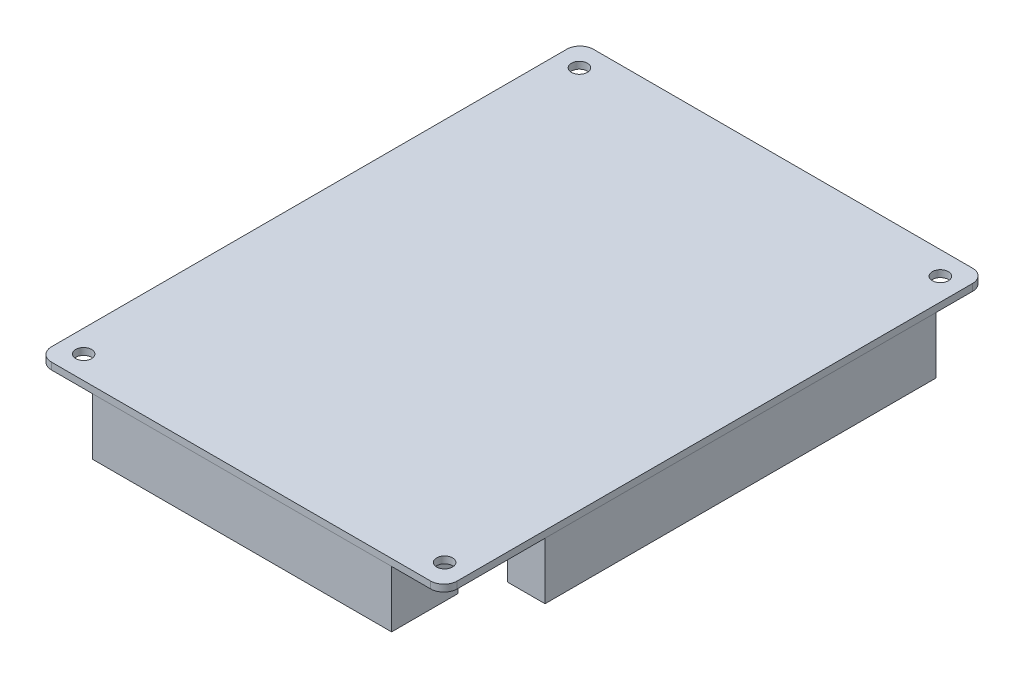
ISO-10303-21;
HEADER;
FILE_DESCRIPTION(('STEP AP214'),'2;1');
FILE_NAME('part.step','',(''),(''),'','','');
FILE_SCHEMA(('AUTOMOTIVE_DESIGN { 1 0 10303 214 1 1 1 1 }'));
ENDSEC;
DATA;
#1=APPLICATION_CONTEXT('core data for automotive mechanical design processes');
#2=APPLICATION_PROTOCOL_DEFINITION('international standard','automotive_design',2000,#1);
#3=PRODUCT_CONTEXT('',#1,'mechanical');
#4=PRODUCT('Part','Part','',(#3));
#5=PRODUCT_RELATED_PRODUCT_CATEGORY('part','',(#4));
#6=PRODUCT_DEFINITION_FORMATION('','',#4);
#7=PRODUCT_DEFINITION_CONTEXT('part definition',#1,'design');
#8=PRODUCT_DEFINITION('design','',#6,#7);
#9=PRODUCT_DEFINITION_SHAPE('','',#8);
#10=(LENGTH_UNIT() NAMED_UNIT(*) SI_UNIT(.MILLI.,.METRE.));
#11=(NAMED_UNIT(*) PLANE_ANGLE_UNIT() SI_UNIT($,.RADIAN.));
#12=(NAMED_UNIT(*) SI_UNIT($,.STERADIAN.) SOLID_ANGLE_UNIT());
#13=UNCERTAINTY_MEASURE_WITH_UNIT(LENGTH_MEASURE(1.E-05),#10,'distance_accuracy_value','');
#14=(GEOMETRIC_REPRESENTATION_CONTEXT(3) GLOBAL_UNCERTAINTY_ASSIGNED_CONTEXT((#13)) GLOBAL_UNIT_ASSIGNED_CONTEXT((#10,
#11,#12)) REPRESENTATION_CONTEXT('',''));
#15=CARTESIAN_POINT('',(0.,0.,0.));
#16=DIRECTION('',(0.,0.,1.));
#17=DIRECTION('',(1.,0.,0.));
#18=AXIS2_PLACEMENT_3D('',#15,#16,#17);
#19=CARTESIAN_POINT('',(0.,0.,0.));
#20=DIRECTION('',(0.,1.,0.));
#21=DIRECTION('',(0.,0.,1.));
#22=AXIS2_PLACEMENT_3D('',#19,#20,#21);
#23=PLANE('',#22);
#24=DIRECTION('',(0.,0.,-1.));
#25=VECTOR('',#24,1.);
#26=CARTESIAN_POINT('',(-45.55,0.,-50.1));
#27=LINE('',#26,#25);
#28=CARTESIAN_POINT('',(-45.55,0.,40.1));
#29=VERTEX_POINT('',#28);
#30=CARTESIAN_POINT('',(-45.55,0.,-50.1));
#31=VERTEX_POINT('',#30);
#32=EDGE_CURVE('E214',#29,#31,#27,.T.);
#33=ORIENTED_EDGE('',*,*,#32,.F.);
#34=DIRECTION('',(-1.,0.,0.));
#35=VECTOR('',#34,1.);
#36=CARTESIAN_POINT('',(-45.55,0.,40.1));
#37=LINE('',#36,#35);
#38=CARTESIAN_POINT('',(-37.05,0.,40.1));
#39=VERTEX_POINT('',#38);
#40=EDGE_CURVE('E227',#39,#29,#37,.T.);
#41=ORIENTED_EDGE('',*,*,#40,.F.);
#42=DIRECTION('',(0.,0.,1.));
#43=VECTOR('',#42,1.);
#44=CARTESIAN_POINT('',(-37.05,0.,-50.1));
#45=LINE('',#44,#43);
#46=CARTESIAN_POINT('',(-37.05,0.,-50.1));
#47=VERTEX_POINT('',#46);
#48=EDGE_CURVE('E236',#47,#39,#45,.T.);
#49=ORIENTED_EDGE('',*,*,#48,.F.);
#50=DIRECTION('',(1.,0.,0.));
#51=VECTOR('',#50,1.);
#52=CARTESIAN_POINT('',(-45.55,0.,-50.1));
#53=LINE('',#52,#51);
#54=EDGE_CURVE('E217',#31,#47,#53,.T.);
#55=ORIENTED_EDGE('',*,*,#54,.F.);
#56=EDGE_LOOP('',(#33,#41,#49,#55));
#57=FACE_BOUND('',#56,.T.);
#58=DIRECTION('',(0.,0.,1.));
#59=VECTOR('',#58,1.);
#60=CARTESIAN_POINT('',(45.55,0.,38.1));
#61=LINE('',#60,#59);
#62=CARTESIAN_POINT('',(45.55,0.,-50.1));
#63=VERTEX_POINT('',#62);
#64=CARTESIAN_POINT('',(45.55,0.,38.1));
#65=VERTEX_POINT('',#64);
#66=EDGE_CURVE('E285',#63,#65,#61,.T.);
#67=ORIENTED_EDGE('',*,*,#66,.F.);
#68=DIRECTION('',(1.,0.,0.));
#69=VECTOR('',#68,1.);
#70=CARTESIAN_POINT('',(45.55,0.,-50.1));
#71=LINE('',#70,#69);
#72=CARTESIAN_POINT('',(37.05,0.,-50.1));
#73=VERTEX_POINT('',#72);
#74=EDGE_CURVE('E290',#73,#63,#71,.T.);
#75=ORIENTED_EDGE('',*,*,#74,.F.);
#76=DIRECTION('',(0.,0.,-1.));
#77=VECTOR('',#76,1.);
#78=CARTESIAN_POINT('',(37.05,0.,38.1));
#79=LINE('',#78,#77);
#80=CARTESIAN_POINT('',(37.05,0.,38.1));
#81=VERTEX_POINT('',#80);
#82=EDGE_CURVE('E302',#81,#73,#79,.T.);
#83=ORIENTED_EDGE('',*,*,#82,.F.);
#84=DIRECTION('',(-1.,0.,0.));
#85=VECTOR('',#84,1.);
#86=CARTESIAN_POINT('',(45.55,0.,38.1));
#87=LINE('',#86,#85);
#88=EDGE_CURVE('E299',#65,#81,#87,.T.);
#89=ORIENTED_EDGE('',*,*,#88,.F.);
#90=EDGE_LOOP('',(#67,#75,#83,#89));
#91=FACE_BOUND('',#90,.T.);
#92=CARTESIAN_POINT('',(-40.7,0.,-55.9));
#93=DIRECTION('',(0.,1.,0.));
#94=DIRECTION('',(0.,0.,1.));
#95=AXIS2_PLACEMENT_3D('',#92,#93,#94);
#96=CIRCLE('',#95,1.8);
#97=CARTESIAN_POINT('',(-40.7,0.,-54.1));
#98=VERTEX_POINT('',#97);
#99=EDGE_CURVE('E321',#98,#98,#96,.T.);
#100=ORIENTED_EDGE('',*,*,#99,.T.);
#101=EDGE_LOOP('',(#100));
#102=FACE_BOUND('',#101,.T.);
#103=CARTESIAN_POINT('',(40.7,0.,55.9));
#104=DIRECTION('',(0.,1.,0.));
#105=DIRECTION('',(0.,0.,1.));
#106=AXIS2_PLACEMENT_3D('',#103,#104,#105);
#107=CIRCLE('',#106,1.8);
#108=CARTESIAN_POINT('',(40.7,0.,57.7));
#109=VERTEX_POINT('',#108);
#110=EDGE_CURVE('E327',#109,#109,#107,.T.);
#111=ORIENTED_EDGE('',*,*,#110,.T.);
#112=EDGE_LOOP('',(#111));
#113=FACE_BOUND('',#112,.T.);
#114=CARTESIAN_POINT('',(40.7,0.,-55.9));
#115=DIRECTION('',(0.,1.,0.));
#116=DIRECTION('',(0.,0.,1.));
#117=AXIS2_PLACEMENT_3D('',#114,#115,#116);
#118=CIRCLE('',#117,1.8);
#119=CARTESIAN_POINT('',(40.7,0.,-54.1));
#120=VERTEX_POINT('',#119);
#121=EDGE_CURVE('E333',#120,#120,#118,.T.);
#122=ORIENTED_EDGE('',*,*,#121,.T.);
#123=EDGE_LOOP('',(#122));
#124=FACE_BOUND('',#123,.T.);
#125=CARTESIAN_POINT('',(-40.7,0.,55.9));
#126=DIRECTION('',(0.,1.,0.));
#127=DIRECTION('',(0.,0.,1.));
#128=AXIS2_PLACEMENT_3D('',#125,#126,#127);
#129=CIRCLE('',#128,1.8);
#130=CARTESIAN_POINT('',(-40.7,0.,57.7));
#131=VERTEX_POINT('',#130);
#132=EDGE_CURVE('E339',#131,#131,#129,.T.);
#133=ORIENTED_EDGE('',*,*,#132,.T.);
#134=EDGE_LOOP('',(#133));
#135=FACE_BOUND('',#134,.T.);
#136=DIRECTION('',(0.,0.,1.));
#137=VECTOR('',#136,1.);
#138=CARTESIAN_POINT('',(-45.75,0.,61.1));
#139=LINE('',#138,#137);
#140=CARTESIAN_POINT('',(-45.75,0.,-58.1));
#141=VERTEX_POINT('',#140);
#142=CARTESIAN_POINT('',(-45.75,0.,58.1));
#143=VERTEX_POINT('',#142);
#144=EDGE_CURVE('E342',#141,#143,#139,.T.);
#145=ORIENTED_EDGE('',*,*,#144,.F.);
#146=CARTESIAN_POINT('',(-42.75,0.,-58.1));
#147=DIRECTION('',(0.,1.,0.));
#148=DIRECTION('',(0.,0.,1.));
#149=AXIS2_PLACEMENT_3D('',#146,#147,#148);
#150=CIRCLE('',#149,3.);
#151=CARTESIAN_POINT('',(-42.75,0.,-61.1));
#152=VERTEX_POINT('',#151);
#153=EDGE_CURVE('E377',#141,#152,#150,.F.);
#154=ORIENTED_EDGE('',*,*,#153,.T.);
#155=DIRECTION('',(-1.,0.,0.));
#156=VECTOR('',#155,1.);
#157=CARTESIAN_POINT('',(45.75,0.,-61.1));
#158=LINE('',#157,#156);
#159=CARTESIAN_POINT('',(42.75,0.,-61.1));
#160=VERTEX_POINT('',#159);
#161=EDGE_CURVE('E347',#160,#152,#158,.T.);
#162=ORIENTED_EDGE('',*,*,#161,.F.);
#163=CARTESIAN_POINT('',(42.75,0.,-58.1));
#164=DIRECTION('',(0.,1.,0.));
#165=DIRECTION('',(0.,0.,1.));
#166=AXIS2_PLACEMENT_3D('',#163,#164,#165);
#167=CIRCLE('',#166,3.);
#168=CARTESIAN_POINT('',(45.75,0.,-58.1));
#169=VERTEX_POINT('',#168);
#170=EDGE_CURVE('E375',#160,#169,#167,.F.);
#171=ORIENTED_EDGE('',*,*,#170,.T.);
#172=DIRECTION('',(0.,0.,-1.));
#173=VECTOR('',#172,1.);
#174=CARTESIAN_POINT('',(45.75,0.,61.1));
#175=LINE('',#174,#173);
#176=CARTESIAN_POINT('',(45.75,0.,58.1));
#177=VERTEX_POINT('',#176);
#178=EDGE_CURVE('E362',#177,#169,#175,.T.);
#179=ORIENTED_EDGE('',*,*,#178,.F.);
#180=CARTESIAN_POINT('',(42.75,0.,58.1));
#181=DIRECTION('',(0.,1.,0.));
#182=DIRECTION('',(0.,0.,1.));
#183=AXIS2_PLACEMENT_3D('',#180,#181,#182);
#184=CIRCLE('',#183,3.);
#185=CARTESIAN_POINT('',(42.75,0.,61.1));
#186=VERTEX_POINT('',#185);
#187=EDGE_CURVE('E373',#177,#186,#184,.F.);
#188=ORIENTED_EDGE('',*,*,#187,.T.);
#189=DIRECTION('',(1.,0.,0.));
#190=VECTOR('',#189,1.);
#191=CARTESIAN_POINT('',(45.75,0.,61.1));
#192=LINE('',#191,#190);
#193=CARTESIAN_POINT('',(-42.75,0.,61.1));
#194=VERTEX_POINT('',#193);
#195=EDGE_CURVE('E359',#194,#186,#192,.T.);
#196=ORIENTED_EDGE('',*,*,#195,.F.);
#197=CARTESIAN_POINT('',(-42.75,0.,58.1));
#198=DIRECTION('',(0.,1.,0.));
#199=DIRECTION('',(0.,0.,1.));
#200=AXIS2_PLACEMENT_3D('',#197,#198,#199);
#201=CIRCLE('',#200,3.);
#202=EDGE_CURVE('E371',#194,#143,#201,.F.);
#203=ORIENTED_EDGE('',*,*,#202,.T.);
#204=EDGE_LOOP('',(#145,#154,#162,#171,#179,#188,#196,#203));
#205=FACE_BOUND('',#204,.T.);
#206=DIRECTION('',(0.,0.,1.));
#207=VECTOR('',#206,1.);
#208=CARTESIAN_POINT('',(18.75,0.,-60.9));
#209=LINE('',#208,#207);
#210=CARTESIAN_POINT('',(18.75,0.,-60.9));
#211=VERTEX_POINT('',#210);
#212=CARTESIAN_POINT('',(18.75,0.,-53.4));
#213=VERTEX_POINT('',#212);
#214=EDGE_CURVE('E252',#211,#213,#209,.T.);
#215=ORIENTED_EDGE('',*,*,#214,.F.);
#216=DIRECTION('',(1.,0.,0.));
#217=VECTOR('',#216,1.);
#218=CARTESIAN_POINT('',(18.75,0.,-60.9));
#219=LINE('',#218,#217);
#220=CARTESIAN_POINT('',(-30.75,0.,-60.9));
#221=VERTEX_POINT('',#220);
#222=EDGE_CURVE('E257',#221,#211,#219,.T.);
#223=ORIENTED_EDGE('',*,*,#222,.F.);
#224=DIRECTION('',(0.,0.,-1.));
#225=VECTOR('',#224,1.);
#226=CARTESIAN_POINT('',(-30.75,0.,-60.9));
#227=LINE('',#226,#225);
#228=CARTESIAN_POINT('',(-30.75,0.,-53.4));
#229=VERTEX_POINT('',#228);
#230=EDGE_CURVE('E269',#229,#221,#227,.T.);
#231=ORIENTED_EDGE('',*,*,#230,.F.);
#232=DIRECTION('',(-1.,0.,0.));
#233=VECTOR('',#232,1.);
#234=CARTESIAN_POINT('',(18.75,0.,-53.4));
#235=LINE('',#234,#233);
#236=EDGE_CURVE('E266',#213,#229,#235,.T.);
#237=ORIENTED_EDGE('',*,*,#236,.F.);
#238=EDGE_LOOP('',(#215,#223,#231,#237));
#239=FACE_BOUND('',#238,.T.);
#240=DIRECTION('',(0.,0.,1.));
#241=VECTOR('',#240,1.);
#242=CARTESIAN_POINT('',(33.75,0.,60.9));
#243=LINE('',#242,#241);
#244=CARTESIAN_POINT('',(33.75,0.,45.9));
#245=VERTEX_POINT('',#244);
#246=CARTESIAN_POINT('',(33.75,0.,60.9));
#247=VERTEX_POINT('',#246);
#248=EDGE_CURVE('E213',#245,#247,#243,.T.);
#249=ORIENTED_EDGE('',*,*,#248,.F.);
#250=DIRECTION('',(1.,0.,0.));
#251=VECTOR('',#250,1.);
#252=CARTESIAN_POINT('',(33.75,0.,45.9));
#253=LINE('',#252,#251);
#254=CARTESIAN_POINT('',(-33.75,0.,45.9));
#255=VERTEX_POINT('',#254);
#256=EDGE_CURVE('E210',#255,#245,#253,.T.);
#257=ORIENTED_EDGE('',*,*,#256,.F.);
#258=DIRECTION('',(0.,0.,-1.));
#259=VECTOR('',#258,1.);
#260=CARTESIAN_POINT('',(-33.75,0.,60.9));
#261=LINE('',#260,#259);
#262=CARTESIAN_POINT('',(-33.75,0.,60.9));
#263=VERTEX_POINT('',#262);
#264=EDGE_CURVE('E53',#263,#255,#261,.T.);
#265=ORIENTED_EDGE('',*,*,#264,.F.);
#266=DIRECTION('',(-1.,0.,0.));
#267=VECTOR('',#266,1.);
#268=CARTESIAN_POINT('',(33.75,0.,60.9));
#269=LINE('',#268,#267);
#270=EDGE_CURVE('E48',#247,#263,#269,.T.);
#271=ORIENTED_EDGE('',*,*,#270,.F.);
#272=EDGE_LOOP('',(#249,#257,#265,#271));
#273=FACE_BOUND('',#272,.T.);
#274=ADVANCED_FACE('F33',(#57,#91,#102,#113,#124,#135,#205,#239,#273),#23,.F.);
#275=CARTESIAN_POINT('',(-45.75,1.5494,61.1));
#276=DIRECTION('',(1.,0.,0.));
#277=DIRECTION('',(0.,0.,-1.));
#278=AXIS2_PLACEMENT_3D('',#275,#276,#277);
#279=PLANE('',#278);
#280=DIRECTION('',(0.,0.,1.));
#281=VECTOR('',#280,1.);
#282=CARTESIAN_POINT('',(-45.75,1.5494,61.1));
#283=LINE('',#282,#281);
#284=CARTESIAN_POINT('',(-45.75,1.5494,-58.1));
#285=VERTEX_POINT('',#284);
#286=CARTESIAN_POINT('',(-45.75,1.5494,58.1));
#287=VERTEX_POINT('',#286);
#288=EDGE_CURVE('E343',#285,#287,#283,.T.);
#289=ORIENTED_EDGE('',*,*,#288,.F.);
#290=DIRECTION('',(0.,-1.,0.));
#291=VECTOR('',#290,1.);
#292=CARTESIAN_POINT('',(-45.75,1.5494,-58.1));
#293=LINE('',#292,#291);
#294=EDGE_CURVE('E368',#285,#141,#293,.T.);
#295=ORIENTED_EDGE('',*,*,#294,.T.);
#296=ORIENTED_EDGE('',*,*,#144,.T.);
#297=DIRECTION('',(0.,-1.,0.));
#298=VECTOR('',#297,1.);
#299=CARTESIAN_POINT('',(-45.75,1.5494,58.1));
#300=LINE('',#299,#298);
#301=EDGE_CURVE('E356',#143,#287,#300,.F.);
#302=ORIENTED_EDGE('',*,*,#301,.T.);
#303=EDGE_LOOP('',(#289,#295,#296,#302));
#304=FACE_BOUND('',#303,.T.);
#305=ADVANCED_FACE('F434',(#304),#279,.F.);
#306=CARTESIAN_POINT('',(45.75,1.5494,61.1));
#307=DIRECTION('',(0.,0.,-1.));
#308=DIRECTION('',(-1.,0.,0.));
#309=AXIS2_PLACEMENT_3D('',#306,#307,#308);
#310=PLANE('',#309);
#311=ORIENTED_EDGE('',*,*,#195,.T.);
#312=DIRECTION('',(0.,-1.,0.));
#313=VECTOR('',#312,1.);
#314=CARTESIAN_POINT('',(42.75,1.5494,61.1));
#315=LINE('',#314,#313);
#316=CARTESIAN_POINT('',(42.75,1.5494,61.1));
#317=VERTEX_POINT('',#316);
#318=EDGE_CURVE('E11',#186,#317,#315,.F.);
#319=ORIENTED_EDGE('',*,*,#318,.T.);
#320=DIRECTION('',(1.,0.,0.));
#321=VECTOR('',#320,1.);
#322=CARTESIAN_POINT('',(45.75,1.5494,61.1));
#323=LINE('',#322,#321);
#324=CARTESIAN_POINT('',(-42.75,1.5494,61.1));
#325=VERTEX_POINT('',#324);
#326=EDGE_CURVE('E346',#325,#317,#323,.T.);
#327=ORIENTED_EDGE('',*,*,#326,.F.);
#328=DIRECTION('',(0.,-1.,0.));
#329=VECTOR('',#328,1.);
#330=CARTESIAN_POINT('',(-42.75,1.5494,61.1));
#331=LINE('',#330,#329);
#332=EDGE_CURVE('E41',#325,#194,#331,.T.);
#333=ORIENTED_EDGE('',*,*,#332,.T.);
#334=EDGE_LOOP('',(#311,#319,#327,#333));
#335=FACE_BOUND('',#334,.T.);
#336=ADVANCED_FACE('F401',(#335),#310,.F.);
#337=CARTESIAN_POINT('',(45.75,1.5494,61.1));
#338=DIRECTION('',(-1.,0.,0.));
#339=DIRECTION('',(0.,0.,1.));
#340=AXIS2_PLACEMENT_3D('',#337,#338,#339);
#341=PLANE('',#340);
#342=ORIENTED_EDGE('',*,*,#178,.T.);
#343=DIRECTION('',(0.,-1.,0.));
#344=VECTOR('',#343,1.);
#345=CARTESIAN_POINT('',(45.75,1.5494,-58.1));
#346=LINE('',#345,#344);
#347=CARTESIAN_POINT('',(45.75,1.5494,-58.1));
#348=VERTEX_POINT('',#347);
#349=EDGE_CURVE('E395',#169,#348,#346,.F.);
#350=ORIENTED_EDGE('',*,*,#349,.T.);
#351=DIRECTION('',(0.,0.,-1.));
#352=VECTOR('',#351,1.);
#353=CARTESIAN_POINT('',(45.75,1.5494,61.1));
#354=LINE('',#353,#352);
#355=CARTESIAN_POINT('',(45.75,1.5494,58.1));
#356=VERTEX_POINT('',#355);
#357=EDGE_CURVE('E350',#356,#348,#354,.T.);
#358=ORIENTED_EDGE('',*,*,#357,.F.);
#359=DIRECTION('',(0.,-1.,0.));
#360=VECTOR('',#359,1.);
#361=CARTESIAN_POINT('',(45.75,1.5494,58.1));
#362=LINE('',#361,#360);
#363=EDGE_CURVE('E392',#356,#177,#362,.T.);
#364=ORIENTED_EDGE('',*,*,#363,.T.);
#365=EDGE_LOOP('',(#342,#350,#358,#364));
#366=FACE_BOUND('',#365,.T.);
#367=ADVANCED_FACE('F415',(#366),#341,.F.);
#368=CARTESIAN_POINT('',(45.75,1.5494,-61.1));
#369=DIRECTION('',(0.,0.,1.));
#370=DIRECTION('',(1.,0.,0.));
#371=AXIS2_PLACEMENT_3D('',#368,#369,#370);
#372=PLANE('',#371);
#373=ORIENTED_EDGE('',*,*,#161,.T.);
#374=DIRECTION('',(0.,-1.,0.));
#375=VECTOR('',#374,1.);
#376=CARTESIAN_POINT('',(-42.75,1.5494,-61.1));
#377=LINE('',#376,#375);
#378=CARTESIAN_POINT('',(-42.75,1.5494,-61.1));
#379=VERTEX_POINT('',#378);
#380=EDGE_CURVE('E382',#152,#379,#377,.F.);
#381=ORIENTED_EDGE('',*,*,#380,.T.);
#382=DIRECTION('',(-1.,0.,0.));
#383=VECTOR('',#382,1.);
#384=CARTESIAN_POINT('',(45.75,1.5494,-61.1));
#385=LINE('',#384,#383);
#386=CARTESIAN_POINT('',(42.75,1.5494,-61.1));
#387=VERTEX_POINT('',#386);
#388=EDGE_CURVE('E353',#387,#379,#385,.T.);
#389=ORIENTED_EDGE('',*,*,#388,.F.);
#390=DIRECTION('',(0.,-1.,0.));
#391=VECTOR('',#390,1.);
#392=CARTESIAN_POINT('',(42.75,1.5494,-61.1));
#393=LINE('',#392,#391);
#394=EDGE_CURVE('E379',#387,#160,#393,.T.);
#395=ORIENTED_EDGE('',*,*,#394,.T.);
#396=EDGE_LOOP('',(#373,#381,#389,#395));
#397=FACE_BOUND('',#396,.T.);
#398=ADVANCED_FACE('F426',(#397),#372,.F.);
#399=CARTESIAN_POINT('',(0.,1.5494,0.));
#400=DIRECTION('',(0.,1.,0.));
#401=DIRECTION('',(0.,0.,1.));
#402=AXIS2_PLACEMENT_3D('',#399,#400,#401);
#403=PLANE('',#402);
#404=CARTESIAN_POINT('',(-40.7,1.5494,-55.9));
#405=DIRECTION('',(0.,1.,0.));
#406=DIRECTION('',(0.,0.,1.));
#407=AXIS2_PLACEMENT_3D('',#404,#405,#406);
#408=CIRCLE('',#407,1.8);
#409=CARTESIAN_POINT('',(-40.7,1.5494,-54.1));
#410=VERTEX_POINT('',#409);
#411=EDGE_CURVE('E318',#410,#410,#408,.T.);
#412=ORIENTED_EDGE('',*,*,#411,.F.);
#413=EDGE_LOOP('',(#412));
#414=FACE_BOUND('',#413,.T.);
#415=CARTESIAN_POINT('',(40.7,1.5494,55.9));
#416=DIRECTION('',(0.,1.,0.));
#417=DIRECTION('',(0.,0.,1.));
#418=AXIS2_PLACEMENT_3D('',#415,#416,#417);
#419=CIRCLE('',#418,1.8);
#420=CARTESIAN_POINT('',(40.7,1.5494,57.7));
#421=VERTEX_POINT('',#420);
#422=EDGE_CURVE('E324',#421,#421,#419,.T.);
#423=ORIENTED_EDGE('',*,*,#422,.F.);
#424=EDGE_LOOP('',(#423));
#425=FACE_BOUND('',#424,.T.);
#426=CARTESIAN_POINT('',(40.7,1.5494,-55.9));
#427=DIRECTION('',(0.,1.,0.));
#428=DIRECTION('',(0.,0.,1.));
#429=AXIS2_PLACEMENT_3D('',#426,#427,#428);
#430=CIRCLE('',#429,1.8);
#431=CARTESIAN_POINT('',(40.7,1.5494,-54.1));
#432=VERTEX_POINT('',#431);
#433=EDGE_CURVE('E330',#432,#432,#430,.T.);
#434=ORIENTED_EDGE('',*,*,#433,.F.);
#435=EDGE_LOOP('',(#434));
#436=FACE_BOUND('',#435,.T.);
#437=CARTESIAN_POINT('',(-40.7,1.5494,55.9));
#438=DIRECTION('',(0.,1.,0.));
#439=DIRECTION('',(0.,0.,1.));
#440=AXIS2_PLACEMENT_3D('',#437,#438,#439);
#441=CIRCLE('',#440,1.8);
#442=CARTESIAN_POINT('',(-40.7,1.5494,57.7));
#443=VERTEX_POINT('',#442);
#444=EDGE_CURVE('E336',#443,#443,#441,.T.);
#445=ORIENTED_EDGE('',*,*,#444,.F.);
#446=EDGE_LOOP('',(#445));
#447=FACE_BOUND('',#446,.T.);
#448=ORIENTED_EDGE('',*,*,#388,.T.);
#449=CARTESIAN_POINT('',(-42.75,1.5494,-58.1));
#450=DIRECTION('',(0.,1.,0.));
#451=DIRECTION('',(0.,0.,1.));
#452=AXIS2_PLACEMENT_3D('',#449,#450,#451);
#453=CIRCLE('',#452,3.);
#454=EDGE_CURVE('E390',#379,#285,#453,.T.);
#455=ORIENTED_EDGE('',*,*,#454,.T.);
#456=ORIENTED_EDGE('',*,*,#288,.T.);
#457=CARTESIAN_POINT('',(-42.75,1.5494,58.1));
#458=DIRECTION('',(0.,1.,0.));
#459=DIRECTION('',(0.,0.,1.));
#460=AXIS2_PLACEMENT_3D('',#457,#458,#459);
#461=CIRCLE('',#460,3.);
#462=EDGE_CURVE('E384',#287,#325,#461,.T.);
#463=ORIENTED_EDGE('',*,*,#462,.T.);
#464=ORIENTED_EDGE('',*,*,#326,.T.);
#465=CARTESIAN_POINT('',(42.75,1.5494,58.1));
#466=DIRECTION('',(0.,1.,0.));
#467=DIRECTION('',(0.,0.,1.));
#468=AXIS2_PLACEMENT_3D('',#465,#466,#467);
#469=CIRCLE('',#468,3.);
#470=EDGE_CURVE('E386',#317,#356,#469,.T.);
#471=ORIENTED_EDGE('',*,*,#470,.T.);
#472=ORIENTED_EDGE('',*,*,#357,.T.);
#473=CARTESIAN_POINT('',(42.75,1.5494,-58.1));
#474=DIRECTION('',(0.,1.,0.));
#475=DIRECTION('',(0.,0.,1.));
#476=AXIS2_PLACEMENT_3D('',#473,#474,#475);
#477=CIRCLE('',#476,3.);
#478=EDGE_CURVE('E388',#348,#387,#477,.T.);
#479=ORIENTED_EDGE('',*,*,#478,.T.);
#480=EDGE_LOOP('',(#448,#455,#456,#463,#464,#471,#472,#479));
#481=FACE_BOUND('',#480,.T.);
#482=ADVANCED_FACE('F419',(#414,#425,#436,#447,#481),#403,.T.);
#483=CARTESIAN_POINT('',(-40.7,1.5494,55.9));
#484=DIRECTION('',(0.,1.,0.));
#485=DIRECTION('',(0.,0.,1.));
#486=AXIS2_PLACEMENT_3D('',#483,#484,#485);
#487=CYLINDRICAL_SURFACE('',#486,1.8);
#488=ORIENTED_EDGE('',*,*,#444,.T.);
#489=EDGE_LOOP('',(#488));
#490=FACE_BOUND('',#489,.T.);
#491=ORIENTED_EDGE('',*,*,#132,.F.);
#492=EDGE_LOOP('',(#491));
#493=FACE_BOUND('',#492,.T.);
#494=ADVANCED_FACE('F685',(#490,#493),#487,.F.);
#495=CARTESIAN_POINT('',(40.7,1.5494,-55.9));
#496=DIRECTION('',(0.,1.,0.));
#497=DIRECTION('',(0.,0.,1.));
#498=AXIS2_PLACEMENT_3D('',#495,#496,#497);
#499=CYLINDRICAL_SURFACE('',#498,1.8);
#500=ORIENTED_EDGE('',*,*,#433,.T.);
#501=EDGE_LOOP('',(#500));
#502=FACE_BOUND('',#501,.T.);
#503=ORIENTED_EDGE('',*,*,#121,.F.);
#504=EDGE_LOOP('',(#503));
#505=FACE_BOUND('',#504,.T.);
#506=ADVANCED_FACE('F682',(#502,#505),#499,.F.);
#507=CARTESIAN_POINT('',(40.7,1.5494,55.9));
#508=DIRECTION('',(0.,1.,0.));
#509=DIRECTION('',(0.,0.,1.));
#510=AXIS2_PLACEMENT_3D('',#507,#508,#509);
#511=CYLINDRICAL_SURFACE('',#510,1.8);
#512=ORIENTED_EDGE('',*,*,#422,.T.);
#513=EDGE_LOOP('',(#512));
#514=FACE_BOUND('',#513,.T.);
#515=ORIENTED_EDGE('',*,*,#110,.F.);
#516=EDGE_LOOP('',(#515));
#517=FACE_BOUND('',#516,.T.);
#518=ADVANCED_FACE('F678',(#514,#517),#511,.F.);
#519=CARTESIAN_POINT('',(-40.7,1.5494,-55.9));
#520=DIRECTION('',(0.,1.,0.));
#521=DIRECTION('',(0.,0.,1.));
#522=AXIS2_PLACEMENT_3D('',#519,#520,#521);
#523=CYLINDRICAL_SURFACE('',#522,1.8);
#524=ORIENTED_EDGE('',*,*,#411,.T.);
#525=EDGE_LOOP('',(#524));
#526=FACE_BOUND('',#525,.T.);
#527=ORIENTED_EDGE('',*,*,#99,.F.);
#528=EDGE_LOOP('',(#527));
#529=FACE_BOUND('',#528,.T.);
#530=ADVANCED_FACE('F464',(#526,#529),#523,.F.);
#531=CARTESIAN_POINT('',(-42.75,1.5494,-58.1));
#532=DIRECTION('',(0.,-1.,0.));
#533=DIRECTION('',(0.,0.,-1.));
#534=AXIS2_PLACEMENT_3D('',#531,#532,#533);
#535=CYLINDRICAL_SURFACE('',#534,3.);
#536=ORIENTED_EDGE('',*,*,#454,.F.);
#537=ORIENTED_EDGE('',*,*,#380,.F.);
#538=ORIENTED_EDGE('',*,*,#153,.F.);
#539=ORIENTED_EDGE('',*,*,#294,.F.);
#540=EDGE_LOOP('',(#536,#537,#538,#539));
#541=FACE_BOUND('',#540,.T.);
#542=ADVANCED_FACE('F431',(#541),#535,.T.);
#543=CARTESIAN_POINT('',(42.75,1.5494,-58.1));
#544=DIRECTION('',(0.,-1.,0.));
#545=DIRECTION('',(0.,0.,-1.));
#546=AXIS2_PLACEMENT_3D('',#543,#544,#545);
#547=CYLINDRICAL_SURFACE('',#546,3.);
#548=ORIENTED_EDGE('',*,*,#478,.F.);
#549=ORIENTED_EDGE('',*,*,#349,.F.);
#550=ORIENTED_EDGE('',*,*,#170,.F.);
#551=ORIENTED_EDGE('',*,*,#394,.F.);
#552=EDGE_LOOP('',(#548,#549,#550,#551));
#553=FACE_BOUND('',#552,.T.);
#554=ADVANCED_FACE('F423',(#553),#547,.T.);
#555=CARTESIAN_POINT('',(42.75,1.5494,58.1));
#556=DIRECTION('',(0.,-1.,0.));
#557=DIRECTION('',(0.,0.,-1.));
#558=AXIS2_PLACEMENT_3D('',#555,#556,#557);
#559=CYLINDRICAL_SURFACE('',#558,3.);
#560=ORIENTED_EDGE('',*,*,#470,.F.);
#561=ORIENTED_EDGE('',*,*,#318,.F.);
#562=ORIENTED_EDGE('',*,*,#187,.F.);
#563=ORIENTED_EDGE('',*,*,#363,.F.);
#564=EDGE_LOOP('',(#560,#561,#562,#563));
#565=FACE_BOUND('',#564,.T.);
#566=ADVANCED_FACE('F412',(#565),#559,.T.);
#567=CARTESIAN_POINT('',(-42.75,1.5494,58.1));
#568=DIRECTION('',(0.,-1.,0.));
#569=DIRECTION('',(0.,0.,-1.));
#570=AXIS2_PLACEMENT_3D('',#567,#568,#569);
#571=CYLINDRICAL_SURFACE('',#570,3.);
#572=ORIENTED_EDGE('',*,*,#462,.F.);
#573=ORIENTED_EDGE('',*,*,#301,.F.);
#574=ORIENTED_EDGE('',*,*,#202,.F.);
#575=ORIENTED_EDGE('',*,*,#332,.F.);
#576=EDGE_LOOP('',(#572,#573,#574,#575));
#577=FACE_BOUND('',#576,.T.);
#578=ADVANCED_FACE('F35',(#577),#571,.T.);
#579=CARTESIAN_POINT('',(45.55,-13.,38.1));
#580=DIRECTION('',(-1.,0.,0.));
#581=DIRECTION('',(0.,0.,1.));
#582=AXIS2_PLACEMENT_3D('',#579,#580,#581);
#583=PLANE('',#582);
#584=ORIENTED_EDGE('',*,*,#66,.T.);
#585=DIRECTION('',(0.,1.,0.));
#586=VECTOR('',#585,1.);
#587=CARTESIAN_POINT('',(45.55,-13.,38.1));
#588=LINE('',#587,#586);
#589=CARTESIAN_POINT('',(45.55,-13.,38.1));
#590=VERTEX_POINT('',#589);
#591=EDGE_CURVE('E315',#590,#65,#588,.T.);
#592=ORIENTED_EDGE('',*,*,#591,.F.);
#593=DIRECTION('',(0.,0.,1.));
#594=VECTOR('',#593,1.);
#595=CARTESIAN_POINT('',(45.55,-13.,38.1));
#596=LINE('',#595,#594);
#597=CARTESIAN_POINT('',(45.55,-13.,-50.1));
#598=VERTEX_POINT('',#597);
#599=EDGE_CURVE('E286',#598,#590,#596,.T.);
#600=ORIENTED_EDGE('',*,*,#599,.F.);
#601=DIRECTION('',(0.,1.,0.));
#602=VECTOR('',#601,1.);
#603=CARTESIAN_POINT('',(45.55,-13.,-50.1));
#604=LINE('',#603,#602);
#605=EDGE_CURVE('E296',#598,#63,#604,.T.);
#606=ORIENTED_EDGE('',*,*,#605,.T.);
#607=EDGE_LOOP('',(#584,#592,#600,#606));
#608=FACE_BOUND('',#607,.T.);
#609=ADVANCED_FACE('F437',(#608),#583,.F.);
#610=CARTESIAN_POINT('',(45.55,-13.,38.1));
#611=DIRECTION('',(0.,0.,-1.));
#612=DIRECTION('',(-1.,0.,0.));
#613=AXIS2_PLACEMENT_3D('',#610,#611,#612);
#614=PLANE('',#613);
#615=ORIENTED_EDGE('',*,*,#88,.T.);
#616=DIRECTION('',(0.,1.,0.));
#617=VECTOR('',#616,1.);
#618=CARTESIAN_POINT('',(37.05,-13.,38.1));
#619=LINE('',#618,#617);
#620=CARTESIAN_POINT('',(37.05,-13.,38.1));
#621=VERTEX_POINT('',#620);
#622=EDGE_CURVE('E312',#621,#81,#619,.T.);
#623=ORIENTED_EDGE('',*,*,#622,.F.);
#624=DIRECTION('',(-1.,0.,0.));
#625=VECTOR('',#624,1.);
#626=CARTESIAN_POINT('',(45.55,-13.,38.1));
#627=LINE('',#626,#625);
#628=EDGE_CURVE('E289',#590,#621,#627,.T.);
#629=ORIENTED_EDGE('',*,*,#628,.F.);
#630=ORIENTED_EDGE('',*,*,#591,.T.);
#631=EDGE_LOOP('',(#615,#623,#629,#630));
#632=FACE_BOUND('',#631,.T.);
#633=ADVANCED_FACE('F442',(#632),#614,.F.);
#634=CARTESIAN_POINT('',(37.05,-13.,38.1));
#635=DIRECTION('',(1.,0.,0.));
#636=DIRECTION('',(0.,0.,-1.));
#637=AXIS2_PLACEMENT_3D('',#634,#635,#636);
#638=PLANE('',#637);
#639=ORIENTED_EDGE('',*,*,#82,.T.);
#640=DIRECTION('',(0.,1.,0.));
#641=VECTOR('',#640,1.);
#642=CARTESIAN_POINT('',(37.05,-13.,-50.1));
#643=LINE('',#642,#641);
#644=CARTESIAN_POINT('',(37.05,-13.,-50.1));
#645=VERTEX_POINT('',#644);
#646=EDGE_CURVE('E309',#645,#73,#643,.T.);
#647=ORIENTED_EDGE('',*,*,#646,.F.);
#648=DIRECTION('',(0.,0.,-1.));
#649=VECTOR('',#648,1.);
#650=CARTESIAN_POINT('',(37.05,-13.,38.1));
#651=LINE('',#650,#649);
#652=EDGE_CURVE('E292',#621,#645,#651,.T.);
#653=ORIENTED_EDGE('',*,*,#652,.F.);
#654=ORIENTED_EDGE('',*,*,#622,.T.);
#655=EDGE_LOOP('',(#639,#647,#653,#654));
#656=FACE_BOUND('',#655,.T.);
#657=ADVANCED_FACE('F498',(#656),#638,.F.);
#658=CARTESIAN_POINT('',(45.55,-13.,-50.1));
#659=DIRECTION('',(0.,0.,1.));
#660=DIRECTION('',(1.,0.,0.));
#661=AXIS2_PLACEMENT_3D('',#658,#659,#660);
#662=PLANE('',#661);
#663=ORIENTED_EDGE('',*,*,#74,.T.);
#664=ORIENTED_EDGE('',*,*,#605,.F.);
#665=DIRECTION('',(1.,0.,0.));
#666=VECTOR('',#665,1.);
#667=CARTESIAN_POINT('',(45.55,-13.,-50.1));
#668=LINE('',#667,#666);
#669=EDGE_CURVE('E294',#645,#598,#668,.T.);
#670=ORIENTED_EDGE('',*,*,#669,.F.);
#671=ORIENTED_EDGE('',*,*,#646,.T.);
#672=EDGE_LOOP('',(#663,#664,#670,#671));
#673=FACE_BOUND('',#672,.T.);
#674=ADVANCED_FACE('F508',(#673),#662,.F.);
#675=CARTESIAN_POINT('',(0.,-13.,0.));
#676=DIRECTION('',(0.,1.,0.));
#677=DIRECTION('',(0.,0.,1.));
#678=AXIS2_PLACEMENT_3D('',#675,#676,#677);
#679=PLANE('',#678);
#680=ORIENTED_EDGE('',*,*,#599,.T.);
#681=ORIENTED_EDGE('',*,*,#628,.T.);
#682=ORIENTED_EDGE('',*,*,#652,.T.);
#683=ORIENTED_EDGE('',*,*,#669,.T.);
#684=EDGE_LOOP('',(#680,#681,#682,#683));
#685=FACE_BOUND('',#684,.T.);
#686=ADVANCED_FACE('F518',(#685),#679,.F.);
#687=CARTESIAN_POINT('',(18.75,-13.,-60.9));
#688=DIRECTION('',(-1.,0.,0.));
#689=DIRECTION('',(0.,0.,1.));
#690=AXIS2_PLACEMENT_3D('',#687,#688,#689);
#691=PLANE('',#690);
#692=ORIENTED_EDGE('',*,*,#214,.T.);
#693=DIRECTION('',(0.,1.,0.));
#694=VECTOR('',#693,1.);
#695=CARTESIAN_POINT('',(18.75,-13.,-53.4));
#696=LINE('',#695,#694);
#697=CARTESIAN_POINT('',(18.75,-13.,-53.4));
#698=VERTEX_POINT('',#697);
#699=EDGE_CURVE('E282',#698,#213,#696,.T.);
#700=ORIENTED_EDGE('',*,*,#699,.F.);
#701=DIRECTION('',(0.,0.,1.));
#702=VECTOR('',#701,1.);
#703=CARTESIAN_POINT('',(18.75,-13.,-60.9));
#704=LINE('',#703,#702);
#705=CARTESIAN_POINT('',(18.75,-13.,-60.9));
#706=VERTEX_POINT('',#705);
#707=EDGE_CURVE('E253',#706,#698,#704,.T.);
#708=ORIENTED_EDGE('',*,*,#707,.F.);
#709=DIRECTION('',(0.,1.,0.));
#710=VECTOR('',#709,1.);
#711=CARTESIAN_POINT('',(18.75,-13.,-60.9));
#712=LINE('',#711,#710);
#713=EDGE_CURVE('E263',#706,#211,#712,.T.);
#714=ORIENTED_EDGE('',*,*,#713,.T.);
#715=EDGE_LOOP('',(#692,#700,#708,#714));
#716=FACE_BOUND('',#715,.T.);
#717=ADVANCED_FACE('F528',(#716),#691,.F.);
#718=CARTESIAN_POINT('',(18.75,-13.,-53.4));
#719=DIRECTION('',(0.,0.,-1.));
#720=DIRECTION('',(-1.,0.,0.));
#721=AXIS2_PLACEMENT_3D('',#718,#719,#720);
#722=PLANE('',#721);
#723=ORIENTED_EDGE('',*,*,#236,.T.);
#724=DIRECTION('',(0.,1.,0.));
#725=VECTOR('',#724,1.);
#726=CARTESIAN_POINT('',(-30.75,-13.,-53.4));
#727=LINE('',#726,#725);
#728=CARTESIAN_POINT('',(-30.75,-13.,-53.4));
#729=VERTEX_POINT('',#728);
#730=EDGE_CURVE('E279',#729,#229,#727,.T.);
#731=ORIENTED_EDGE('',*,*,#730,.F.);
#732=DIRECTION('',(-1.,0.,0.));
#733=VECTOR('',#732,1.);
#734=CARTESIAN_POINT('',(18.75,-13.,-53.4));
#735=LINE('',#734,#733);
#736=EDGE_CURVE('E256',#698,#729,#735,.T.);
#737=ORIENTED_EDGE('',*,*,#736,.F.);
#738=ORIENTED_EDGE('',*,*,#699,.T.);
#739=EDGE_LOOP('',(#723,#731,#737,#738));
#740=FACE_BOUND('',#739,.T.);
#741=ADVANCED_FACE('F538',(#740),#722,.F.);
#742=CARTESIAN_POINT('',(-30.75,-13.,-60.9));
#743=DIRECTION('',(1.,0.,0.));
#744=DIRECTION('',(0.,0.,-1.));
#745=AXIS2_PLACEMENT_3D('',#742,#743,#744);
#746=PLANE('',#745);
#747=ORIENTED_EDGE('',*,*,#230,.T.);
#748=DIRECTION('',(0.,1.,0.));
#749=VECTOR('',#748,1.);
#750=CARTESIAN_POINT('',(-30.75,-13.,-60.9));
#751=LINE('',#750,#749);
#752=CARTESIAN_POINT('',(-30.75,-13.,-60.9));
#753=VERTEX_POINT('',#752);
#754=EDGE_CURVE('E276',#753,#221,#751,.T.);
#755=ORIENTED_EDGE('',*,*,#754,.F.);
#756=DIRECTION('',(0.,0.,-1.));
#757=VECTOR('',#756,1.);
#758=CARTESIAN_POINT('',(-30.75,-13.,-60.9));
#759=LINE('',#758,#757);
#760=EDGE_CURVE('E259',#729,#753,#759,.T.);
#761=ORIENTED_EDGE('',*,*,#760,.F.);
#762=ORIENTED_EDGE('',*,*,#730,.T.);
#763=EDGE_LOOP('',(#747,#755,#761,#762));
#764=FACE_BOUND('',#763,.T.);
#765=ADVANCED_FACE('F548',(#764),#746,.F.);
#766=CARTESIAN_POINT('',(18.75,-13.,-60.9));
#767=DIRECTION('',(0.,0.,1.));
#768=DIRECTION('',(1.,0.,0.));
#769=AXIS2_PLACEMENT_3D('',#766,#767,#768);
#770=PLANE('',#769);
#771=ORIENTED_EDGE('',*,*,#222,.T.);
#772=ORIENTED_EDGE('',*,*,#713,.F.);
#773=DIRECTION('',(1.,0.,0.));
#774=VECTOR('',#773,1.);
#775=CARTESIAN_POINT('',(18.75,-13.,-60.9));
#776=LINE('',#775,#774);
#777=EDGE_CURVE('E261',#753,#706,#776,.T.);
#778=ORIENTED_EDGE('',*,*,#777,.F.);
#779=ORIENTED_EDGE('',*,*,#754,.T.);
#780=EDGE_LOOP('',(#771,#772,#778,#779));
#781=FACE_BOUND('',#780,.T.);
#782=ADVANCED_FACE('F558',(#781),#770,.F.);
#783=CARTESIAN_POINT('',(0.,-13.,0.));
#784=DIRECTION('',(0.,-1.,0.));
#785=DIRECTION('',(0.,0.,-1.));
#786=AXIS2_PLACEMENT_3D('',#783,#784,#785);
#787=PLANE('',#786);
#788=ORIENTED_EDGE('',*,*,#707,.T.);
#789=ORIENTED_EDGE('',*,*,#736,.T.);
#790=ORIENTED_EDGE('',*,*,#760,.T.);
#791=ORIENTED_EDGE('',*,*,#777,.T.);
#792=EDGE_LOOP('',(#788,#789,#790,#791));
#793=FACE_BOUND('',#792,.T.);
#794=ADVANCED_FACE('F568',(#793),#787,.T.);
#795=CARTESIAN_POINT('',(-45.55,-13.,-50.1));
#796=DIRECTION('',(1.,0.,0.));
#797=DIRECTION('',(0.,0.,-1.));
#798=AXIS2_PLACEMENT_3D('',#795,#796,#797);
#799=PLANE('',#798);
#800=ORIENTED_EDGE('',*,*,#32,.T.);
#801=DIRECTION('',(0.,1.,0.));
#802=VECTOR('',#801,1.);
#803=CARTESIAN_POINT('',(-45.55,-13.,-50.1));
#804=LINE('',#803,#802);
#805=CARTESIAN_POINT('',(-45.55,-13.,-50.1));
#806=VERTEX_POINT('',#805);
#807=EDGE_CURVE('E249',#806,#31,#804,.T.);
#808=ORIENTED_EDGE('',*,*,#807,.F.);
#809=DIRECTION('',(0.,0.,-1.));
#810=VECTOR('',#809,1.);
#811=CARTESIAN_POINT('',(-45.55,-13.,-50.1));
#812=LINE('',#811,#810);
#813=CARTESIAN_POINT('',(-45.55,-13.,40.1));
#814=VERTEX_POINT('',#813);
#815=EDGE_CURVE('E223',#814,#806,#812,.T.);
#816=ORIENTED_EDGE('',*,*,#815,.F.);
#817=DIRECTION('',(0.,1.,0.));
#818=VECTOR('',#817,1.);
#819=CARTESIAN_POINT('',(-45.55,-13.,40.1));
#820=LINE('',#819,#818);
#821=EDGE_CURVE('E232',#814,#29,#820,.T.);
#822=ORIENTED_EDGE('',*,*,#821,.T.);
#823=EDGE_LOOP('',(#800,#808,#816,#822));
#824=FACE_BOUND('',#823,.T.);
#825=ADVANCED_FACE('F578',(#824),#799,.F.);
#826=CARTESIAN_POINT('',(-45.55,-13.,-50.1));
#827=DIRECTION('',(0.,0.,1.));
#828=DIRECTION('',(1.,0.,0.));
#829=AXIS2_PLACEMENT_3D('',#826,#827,#828);
#830=PLANE('',#829);
#831=ORIENTED_EDGE('',*,*,#54,.T.);
#832=DIRECTION('',(0.,1.,0.));
#833=VECTOR('',#832,1.);
#834=CARTESIAN_POINT('',(-37.05,-13.,-50.1));
#835=LINE('',#834,#833);
#836=CARTESIAN_POINT('',(-37.05,-13.,-50.1));
#837=VERTEX_POINT('',#836);
#838=EDGE_CURVE('E246',#837,#47,#835,.T.);
#839=ORIENTED_EDGE('',*,*,#838,.F.);
#840=DIRECTION('',(1.,0.,0.));
#841=VECTOR('',#840,1.);
#842=CARTESIAN_POINT('',(-45.55,-13.,-50.1));
#843=LINE('',#842,#841);
#844=EDGE_CURVE('E226',#806,#837,#843,.T.);
#845=ORIENTED_EDGE('',*,*,#844,.F.);
#846=ORIENTED_EDGE('',*,*,#807,.T.);
#847=EDGE_LOOP('',(#831,#839,#845,#846));
#848=FACE_BOUND('',#847,.T.);
#849=ADVANCED_FACE('F588',(#848),#830,.F.);
#850=CARTESIAN_POINT('',(-37.05,-13.,-50.1));
#851=DIRECTION('',(-1.,0.,0.));
#852=DIRECTION('',(0.,0.,1.));
#853=AXIS2_PLACEMENT_3D('',#850,#851,#852);
#854=PLANE('',#853);
#855=ORIENTED_EDGE('',*,*,#48,.T.);
#856=DIRECTION('',(0.,1.,0.));
#857=VECTOR('',#856,1.);
#858=CARTESIAN_POINT('',(-37.05,-13.,40.1));
#859=LINE('',#858,#857);
#860=CARTESIAN_POINT('',(-37.05,-13.,40.1));
#861=VERTEX_POINT('',#860);
#862=EDGE_CURVE('E243',#861,#39,#859,.T.);
#863=ORIENTED_EDGE('',*,*,#862,.F.);
#864=DIRECTION('',(0.,0.,1.));
#865=VECTOR('',#864,1.);
#866=CARTESIAN_POINT('',(-37.05,-13.,-50.1));
#867=LINE('',#866,#865);
#868=EDGE_CURVE('E229',#837,#861,#867,.T.);
#869=ORIENTED_EDGE('',*,*,#868,.F.);
#870=ORIENTED_EDGE('',*,*,#838,.T.);
#871=EDGE_LOOP('',(#855,#863,#869,#870));
#872=FACE_BOUND('',#871,.T.);
#873=ADVANCED_FACE('F598',(#872),#854,.F.);
#874=CARTESIAN_POINT('',(-45.55,-13.,40.1));
#875=DIRECTION('',(0.,0.,-1.));
#876=DIRECTION('',(-1.,0.,0.));
#877=AXIS2_PLACEMENT_3D('',#874,#875,#876);
#878=PLANE('',#877);
#879=ORIENTED_EDGE('',*,*,#40,.T.);
#880=ORIENTED_EDGE('',*,*,#821,.F.);
#881=DIRECTION('',(-1.,0.,0.));
#882=VECTOR('',#881,1.);
#883=CARTESIAN_POINT('',(-45.55,-13.,40.1));
#884=LINE('',#883,#882);
#885=EDGE_CURVE('E231',#861,#814,#884,.T.);
#886=ORIENTED_EDGE('',*,*,#885,.F.);
#887=ORIENTED_EDGE('',*,*,#862,.T.);
#888=EDGE_LOOP('',(#879,#880,#886,#887));
#889=FACE_BOUND('',#888,.T.);
#890=ADVANCED_FACE('F608',(#889),#878,.F.);
#891=CARTESIAN_POINT('',(0.,-13.,0.));
#892=DIRECTION('',(0.,1.,0.));
#893=DIRECTION('',(0.,0.,1.));
#894=AXIS2_PLACEMENT_3D('',#891,#892,#893);
#895=PLANE('',#894);
#896=ORIENTED_EDGE('',*,*,#815,.T.);
#897=ORIENTED_EDGE('',*,*,#844,.T.);
#898=ORIENTED_EDGE('',*,*,#868,.T.);
#899=ORIENTED_EDGE('',*,*,#885,.T.);
#900=EDGE_LOOP('',(#896,#897,#898,#899));
#901=FACE_BOUND('',#900,.T.);
#902=ADVANCED_FACE('F618',(#901),#895,.F.);
#903=CARTESIAN_POINT('',(33.75,-13.,60.9));
#904=DIRECTION('',(-1.,0.,0.));
#905=DIRECTION('',(0.,0.,1.));
#906=AXIS2_PLACEMENT_3D('',#903,#904,#905);
#907=PLANE('',#906);
#908=ORIENTED_EDGE('',*,*,#248,.T.);
#909=DIRECTION('',(0.,1.,0.));
#910=VECTOR('',#909,1.);
#911=CARTESIAN_POINT('',(33.75,-13.,60.9));
#912=LINE('',#911,#910);
#913=CARTESIAN_POINT('',(33.75,-13.,60.9));
#914=VERTEX_POINT('',#913);
#915=EDGE_CURVE('E194',#914,#247,#912,.T.);
#916=ORIENTED_EDGE('',*,*,#915,.F.);
#917=DIRECTION('',(0.,0.,1.));
#918=VECTOR('',#917,1.);
#919=CARTESIAN_POINT('',(33.75,-13.,60.9));
#920=LINE('',#919,#918);
#921=CARTESIAN_POINT('',(33.75,-13.,45.9));
#922=VERTEX_POINT('',#921);
#923=EDGE_CURVE('E201',#922,#914,#920,.T.);
#924=ORIENTED_EDGE('',*,*,#923,.F.);
#925=DIRECTION('',(0.,1.,0.));
#926=VECTOR('',#925,1.);
#927=CARTESIAN_POINT('',(33.75,-13.,45.9));
#928=LINE('',#927,#926);
#929=EDGE_CURVE('E772',#922,#245,#928,.T.);
#930=ORIENTED_EDGE('',*,*,#929,.T.);
#931=EDGE_LOOP('',(#908,#916,#924,#930));
#932=FACE_BOUND('',#931,.T.);
#933=ADVANCED_FACE('F212',(#932),#907,.F.);
#934=CARTESIAN_POINT('',(33.75,-13.,60.9));
#935=DIRECTION('',(0.,0.,-1.));
#936=DIRECTION('',(-1.,0.,0.));
#937=AXIS2_PLACEMENT_3D('',#934,#935,#936);
#938=PLANE('',#937);
#939=ORIENTED_EDGE('',*,*,#270,.T.);
#940=DIRECTION('',(0.,1.,0.));
#941=VECTOR('',#940,1.);
#942=CARTESIAN_POINT('',(-33.75,-13.,60.9));
#943=LINE('',#942,#941);
#944=CARTESIAN_POINT('',(-33.75,-13.,60.9));
#945=VERTEX_POINT('',#944);
#946=EDGE_CURVE('E197',#945,#263,#943,.T.);
#947=ORIENTED_EDGE('',*,*,#946,.F.);
#948=DIRECTION('',(-1.,0.,0.));
#949=VECTOR('',#948,1.);
#950=CARTESIAN_POINT('',(33.75,-13.,60.9));
#951=LINE('',#950,#949);
#952=EDGE_CURVE('E190',#914,#945,#951,.T.);
#953=ORIENTED_EDGE('',*,*,#952,.F.);
#954=ORIENTED_EDGE('',*,*,#915,.T.);
#955=EDGE_LOOP('',(#939,#947,#953,#954));
#956=FACE_BOUND('',#955,.T.);
#957=ADVANCED_FACE('F192',(#956),#938,.F.);
#958=CARTESIAN_POINT('',(-33.75,-13.,60.9));
#959=DIRECTION('',(1.,0.,0.));
#960=DIRECTION('',(0.,0.,-1.));
#961=AXIS2_PLACEMENT_3D('',#958,#959,#960);
#962=PLANE('',#961);
#963=ORIENTED_EDGE('',*,*,#264,.T.);
#964=DIRECTION('',(0.,1.,0.));
#965=VECTOR('',#964,1.);
#966=CARTESIAN_POINT('',(-33.75,-13.,45.9));
#967=LINE('',#966,#965);
#968=CARTESIAN_POINT('',(-33.75,-13.,45.9));
#969=VERTEX_POINT('',#968);
#970=EDGE_CURVE('E219',#969,#255,#967,.T.);
#971=ORIENTED_EDGE('',*,*,#970,.F.);
#972=DIRECTION('',(0.,0.,-1.));
#973=VECTOR('',#972,1.);
#974=CARTESIAN_POINT('',(-33.75,-13.,60.9));
#975=LINE('',#974,#973);
#976=EDGE_CURVE('E200',#945,#969,#975,.T.);
#977=ORIENTED_EDGE('',*,*,#976,.F.);
#978=ORIENTED_EDGE('',*,*,#946,.T.);
#979=EDGE_LOOP('',(#963,#971,#977,#978));
#980=FACE_BOUND('',#979,.T.);
#981=ADVANCED_FACE('F645',(#980),#962,.F.);
#982=CARTESIAN_POINT('',(33.75,-13.,45.9));
#983=DIRECTION('',(0.,0.,1.));
#984=DIRECTION('',(1.,0.,0.));
#985=AXIS2_PLACEMENT_3D('',#982,#983,#984);
#986=PLANE('',#985);
#987=ORIENTED_EDGE('',*,*,#256,.T.);
#988=ORIENTED_EDGE('',*,*,#929,.F.);
#989=DIRECTION('',(1.,0.,0.));
#990=VECTOR('',#989,1.);
#991=CARTESIAN_POINT('',(33.75,-13.,45.9));
#992=LINE('',#991,#990);
#993=EDGE_CURVE('E206',#969,#922,#992,.T.);
#994=ORIENTED_EDGE('',*,*,#993,.F.);
#995=ORIENTED_EDGE('',*,*,#970,.T.);
#996=EDGE_LOOP('',(#987,#988,#994,#995));
#997=FACE_BOUND('',#996,.T.);
#998=ADVANCED_FACE('F654',(#997),#986,.F.);
#999=CARTESIAN_POINT('',(0.,-13.,0.));
#1000=DIRECTION('',(0.,1.,0.));
#1001=DIRECTION('',(0.,0.,1.));
#1002=AXIS2_PLACEMENT_3D('',#999,#1000,#1001);
#1003=PLANE('',#1002);
#1004=ORIENTED_EDGE('',*,*,#923,.T.);
#1005=ORIENTED_EDGE('',*,*,#952,.T.);
#1006=ORIENTED_EDGE('',*,*,#976,.T.);
#1007=ORIENTED_EDGE('',*,*,#993,.T.);
#1008=EDGE_LOOP('',(#1004,#1005,#1006,#1007));
#1009=FACE_BOUND('',#1008,.T.);
#1010=ADVANCED_FACE('F204',(#1009),#1003,.F.);
#1011=CLOSED_SHELL('',(#274,#305,#336,#367,#398,#482,#494,#506,#518,#530,#542,#554,#566,#578,
#609,#633,#657,#674,#686,#717,#741,#765,#782,#794,#825,#849,#873,#890,#902,#933,#957,#981,#998,#1010));
#1012=MANIFOLD_SOLID_BREP('B2',#1011);
#1013=ADVANCED_BREP_SHAPE_REPRESENTATION('',(#18,#1012),#14);
#1014=SHAPE_DEFINITION_REPRESENTATION(#9,#1013);
ENDSEC;
END-ISO-10303-21;
